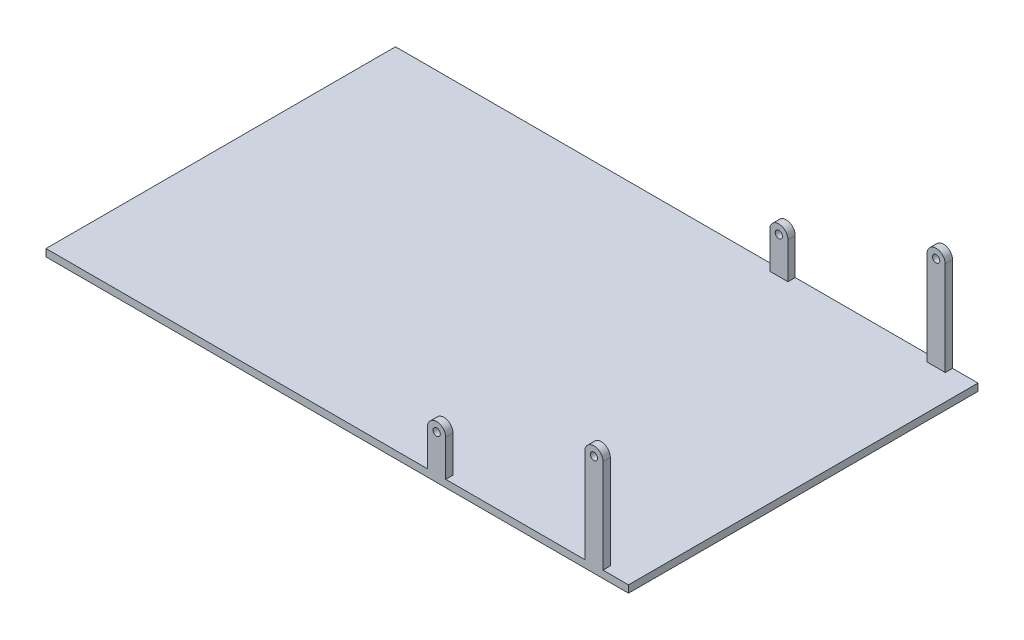
ISO-10303-21;
HEADER;
FILE_DESCRIPTION(('STEP AP214'),'2;1');
FILE_NAME('part.step','',(''),(''),'','','');
FILE_SCHEMA(('AUTOMOTIVE_DESIGN { 1 0 10303 214 1 1 1 1 }'));
ENDSEC;
DATA;
#1=APPLICATION_CONTEXT('core data for automotive mechanical design processes');
#2=APPLICATION_PROTOCOL_DEFINITION('international standard','automotive_design',2000,#1);
#3=PRODUCT_CONTEXT('',#1,'mechanical');
#4=PRODUCT('Part','Part','',(#3));
#5=PRODUCT_RELATED_PRODUCT_CATEGORY('part','',(#4));
#6=PRODUCT_DEFINITION_FORMATION('','',#4);
#7=PRODUCT_DEFINITION_CONTEXT('part definition',#1,'design');
#8=PRODUCT_DEFINITION('design','',#6,#7);
#9=PRODUCT_DEFINITION_SHAPE('','',#8);
#10=(LENGTH_UNIT() NAMED_UNIT(*) SI_UNIT(.MILLI.,.METRE.));
#11=(NAMED_UNIT(*) PLANE_ANGLE_UNIT() SI_UNIT($,.RADIAN.));
#12=(NAMED_UNIT(*) SI_UNIT($,.STERADIAN.) SOLID_ANGLE_UNIT());
#13=UNCERTAINTY_MEASURE_WITH_UNIT(LENGTH_MEASURE(1.E-05),#10,'distance_accuracy_value','');
#14=(GEOMETRIC_REPRESENTATION_CONTEXT(3) GLOBAL_UNCERTAINTY_ASSIGNED_CONTEXT((#13)) GLOBAL_UNIT_ASSIGNED_CONTEXT((#10,
#11,#12)) REPRESENTATION_CONTEXT('',''));
#15=CARTESIAN_POINT('',(0.,0.,0.));
#16=DIRECTION('',(0.,0.,1.));
#17=DIRECTION('',(1.,0.,0.));
#18=AXIS2_PLACEMENT_3D('',#15,#16,#17);
#19=CARTESIAN_POINT('',(800.,-20.,-480.));
#20=DIRECTION('',(1.,0.,0.));
#21=DIRECTION('',(0.,0.,-1.));
#22=AXIS2_PLACEMENT_3D('',#19,#20,#21);
#23=PLANE('',#22);
#24=DIRECTION('',(0.,0.,-1.));
#25=VECTOR('',#24,1.);
#26=CARTESIAN_POINT('',(800.,0.,-480.));
#27=LINE('',#26,#25);
#28=CARTESIAN_POINT('',(800.,0.,480.));
#29=VERTEX_POINT('',#28);
#30=CARTESIAN_POINT('',(800.,0.,-480.));
#31=VERTEX_POINT('',#30);
#32=EDGE_CURVE('E293',#29,#31,#27,.T.);
#33=ORIENTED_EDGE('',*,*,#32,.F.);
#34=DIRECTION('',(0.,1.,0.));
#35=VECTOR('',#34,1.);
#36=CARTESIAN_POINT('',(800.,-20.,480.));
#37=LINE('',#36,#35);
#38=CARTESIAN_POINT('',(800.,-20.,480.));
#39=VERTEX_POINT('',#38);
#40=EDGE_CURVE('E11',#39,#29,#37,.T.);
#41=ORIENTED_EDGE('',*,*,#40,.F.);
#42=DIRECTION('',(0.,0.,-1.));
#43=VECTOR('',#42,1.);
#44=CARTESIAN_POINT('',(800.,-20.,-480.));
#45=LINE('',#44,#43);
#46=CARTESIAN_POINT('',(800.,-20.,-480.));
#47=VERTEX_POINT('',#46);
#48=EDGE_CURVE('E301',#39,#47,#45,.T.);
#49=ORIENTED_EDGE('',*,*,#48,.T.);
#50=DIRECTION('',(0.,1.,0.));
#51=VECTOR('',#50,1.);
#52=CARTESIAN_POINT('',(800.,-20.,-480.));
#53=LINE('',#52,#51);
#54=EDGE_CURVE('E38',#47,#31,#53,.T.);
#55=ORIENTED_EDGE('',*,*,#54,.T.);
#56=EDGE_LOOP('',(#33,#41,#49,#55));
#57=FACE_BOUND('',#56,.T.);
#58=ADVANCED_FACE('F35',(#57),#23,.T.);
#59=CARTESIAN_POINT('',(-800.,-20.,480.));
#60=DIRECTION('',(0.,0.,1.));
#61=DIRECTION('',(1.,0.,0.));
#62=AXIS2_PLACEMENT_3D('',#59,#60,#61);
#63=PLANE('',#62);
#64=DIRECTION('',(0.,1.,0.));
#65=VECTOR('',#64,1.);
#66=CARTESIAN_POINT('',(248.,2.06501482580279E-13,480.));
#67=LINE('',#66,#65);
#68=CARTESIAN_POINT('',(248.,0.,480.));
#69=VERTEX_POINT('',#68);
#70=CARTESIAN_POINT('',(248.,100.,480.));
#71=VERTEX_POINT('',#70);
#72=EDGE_CURVE('E287',#69,#71,#67,.T.);
#73=ORIENTED_EDGE('',*,*,#72,.F.);
#74=DIRECTION('',(1.,0.,0.));
#75=VECTOR('',#74,1.);
#76=CARTESIAN_POINT('',(-800.,0.,480.));
#77=LINE('',#76,#75);
#78=CARTESIAN_POINT('',(-800.,0.,480.));
#79=VERTEX_POINT('',#78);
#80=EDGE_CURVE('E305',#79,#69,#77,.T.);
#81=ORIENTED_EDGE('',*,*,#80,.F.);
#82=DIRECTION('',(0.,1.,0.));
#83=VECTOR('',#82,1.);
#84=CARTESIAN_POINT('',(-800.,-20.,480.));
#85=LINE('',#84,#83);
#86=CARTESIAN_POINT('',(-800.,-20.,480.));
#87=VERTEX_POINT('',#86);
#88=EDGE_CURVE('E43',#87,#79,#85,.T.);
#89=ORIENTED_EDGE('',*,*,#88,.F.);
#90=DIRECTION('',(1.,0.,0.));
#91=VECTOR('',#90,1.);
#92=CARTESIAN_POINT('',(-800.,-20.,480.));
#93=LINE('',#92,#91);
#94=EDGE_CURVE('E311',#87,#39,#93,.T.);
#95=ORIENTED_EDGE('',*,*,#94,.T.);
#96=ORIENTED_EDGE('',*,*,#40,.T.);
#97=CARTESIAN_POINT('',(730.,0.,480.));
#98=VERTEX_POINT('',#97);
#99=EDGE_CURVE('E324',#98,#29,#77,.T.);
#100=ORIENTED_EDGE('',*,*,#99,.F.);
#101=DIRECTION('',(0.,1.,0.));
#102=VECTOR('',#101,1.);
#103=CARTESIAN_POINT('',(730.,0.,480.));
#104=LINE('',#103,#102);
#105=CARTESIAN_POINT('',(730.,258.2,480.));
#106=VERTEX_POINT('',#105);
#107=EDGE_CURVE('E237',#98,#106,#104,.T.);
#108=ORIENTED_EDGE('',*,*,#107,.T.);
#109=CARTESIAN_POINT('',(705.,258.2,480.));
#110=DIRECTION('',(0.,0.,1.));
#111=DIRECTION('',(1.,0.,0.));
#112=AXIS2_PLACEMENT_3D('',#109,#110,#111);
#113=CIRCLE('',#112,25.0000000000001);
#114=CARTESIAN_POINT('',(680.,258.2,480.));
#115=VERTEX_POINT('',#114);
#116=EDGE_CURVE('E250',#115,#106,#113,.F.);
#117=ORIENTED_EDGE('',*,*,#116,.F.);
#118=DIRECTION('',(0.,1.,0.));
#119=VECTOR('',#118,1.);
#120=CARTESIAN_POINT('',(680.,2.92390262101126E-13,480.));
#121=LINE('',#120,#119);
#122=CARTESIAN_POINT('',(680.,0.,480.));
#123=VERTEX_POINT('',#122);
#124=EDGE_CURVE('E253',#123,#115,#121,.T.);
#125=ORIENTED_EDGE('',*,*,#124,.F.);
#126=CARTESIAN_POINT('',(298.,0.,480.));
#127=VERTEX_POINT('',#126);
#128=EDGE_CURVE('E326',#127,#123,#77,.T.);
#129=ORIENTED_EDGE('',*,*,#128,.F.);
#130=DIRECTION('',(0.,1.,0.));
#131=VECTOR('',#130,1.);
#132=CARTESIAN_POINT('',(298.,-3.30846461338296E-13,480.));
#133=LINE('',#132,#131);
#134=CARTESIAN_POINT('',(298.,100.,480.));
#135=VERTEX_POINT('',#134);
#136=EDGE_CURVE('E272',#127,#135,#133,.T.);
#137=ORIENTED_EDGE('',*,*,#136,.T.);
#138=CARTESIAN_POINT('',(273.,100.,480.));
#139=DIRECTION('',(0.,0.,1.));
#140=DIRECTION('',(1.,0.,0.));
#141=AXIS2_PLACEMENT_3D('',#138,#139,#140);
#142=CIRCLE('',#141,25.);
#143=EDGE_CURVE('E284',#71,#135,#142,.F.);
#144=ORIENTED_EDGE('',*,*,#143,.F.);
#145=EDGE_LOOP('',(#73,#81,#89,#95,#96,#100,#108,#117,#125,#129,#137,#144));
#146=FACE_BOUND('',#145,.T.);
#147=CARTESIAN_POINT('',(273.,100.,480.));
#148=DIRECTION('',(0.,0.,1.));
#149=DIRECTION('',(1.,0.,0.));
#150=AXIS2_PLACEMENT_3D('',#147,#148,#149);
#151=CIRCLE('',#150,9.99999999999998);
#152=CARTESIAN_POINT('',(283.,100.,480.));
#153=VERTEX_POINT('',#152);
#154=EDGE_CURVE('E259',#153,#153,#151,.T.);
#155=ORIENTED_EDGE('',*,*,#154,.F.);
#156=EDGE_LOOP('',(#155));
#157=FACE_BOUND('',#156,.T.);
#158=CARTESIAN_POINT('',(705.,258.2,480.));
#159=DIRECTION('',(0.,0.,1.));
#160=DIRECTION('',(1.,0.,0.));
#161=AXIS2_PLACEMENT_3D('',#158,#159,#160);
#162=CIRCLE('',#161,9.99999999999998);
#163=CARTESIAN_POINT('',(715.,258.2,480.));
#164=VERTEX_POINT('',#163);
#165=EDGE_CURVE('E228',#164,#164,#162,.T.);
#166=ORIENTED_EDGE('',*,*,#165,.F.);
#167=EDGE_LOOP('',(#166));
#168=FACE_BOUND('',#167,.T.);
#169=ADVANCED_FACE('F351',(#146,#157,#168),#63,.T.);
#170=CARTESIAN_POINT('',(-800.,-20.,-480.));
#171=DIRECTION('',(-1.,0.,0.));
#172=DIRECTION('',(0.,0.,1.));
#173=AXIS2_PLACEMENT_3D('',#170,#171,#172);
#174=PLANE('',#173);
#175=DIRECTION('',(0.,0.,1.));
#176=VECTOR('',#175,1.);
#177=CARTESIAN_POINT('',(-800.,0.,-480.));
#178=LINE('',#177,#176);
#179=CARTESIAN_POINT('',(-800.,0.,-480.));
#180=VERTEX_POINT('',#179);
#181=EDGE_CURVE('E320',#180,#79,#178,.T.);
#182=ORIENTED_EDGE('',*,*,#181,.F.);
#183=DIRECTION('',(0.,1.,0.));
#184=VECTOR('',#183,1.);
#185=CARTESIAN_POINT('',(-800.,-20.,-480.));
#186=LINE('',#185,#184);
#187=CARTESIAN_POINT('',(-800.,-20.,-480.));
#188=VERTEX_POINT('',#187);
#189=EDGE_CURVE('E328',#188,#180,#186,.T.);
#190=ORIENTED_EDGE('',*,*,#189,.F.);
#191=DIRECTION('',(0.,0.,1.));
#192=VECTOR('',#191,1.);
#193=CARTESIAN_POINT('',(-800.,-20.,-480.));
#194=LINE('',#193,#192);
#195=EDGE_CURVE('E308',#188,#87,#194,.T.);
#196=ORIENTED_EDGE('',*,*,#195,.T.);
#197=ORIENTED_EDGE('',*,*,#88,.T.);
#198=EDGE_LOOP('',(#182,#190,#196,#197));
#199=FACE_BOUND('',#198,.T.);
#200=ADVANCED_FACE('F358',(#199),#174,.T.);
#201=CARTESIAN_POINT('',(-800.,-20.,-480.));
#202=DIRECTION('',(0.,0.,-1.));
#203=DIRECTION('',(-1.,0.,0.));
#204=AXIS2_PLACEMENT_3D('',#201,#202,#203);
#205=PLANE('',#204);
#206=DIRECTION('',(-1.,0.,0.));
#207=VECTOR('',#206,1.);
#208=CARTESIAN_POINT('',(-800.,0.,-480.));
#209=LINE('',#208,#207);
#210=CARTESIAN_POINT('',(730.,0.,-480.));
#211=VERTEX_POINT('',#210);
#212=EDGE_CURVE('E317',#31,#211,#209,.T.);
#213=ORIENTED_EDGE('',*,*,#212,.F.);
#214=ORIENTED_EDGE('',*,*,#54,.F.);
#215=DIRECTION('',(-1.,0.,0.));
#216=VECTOR('',#215,1.);
#217=CARTESIAN_POINT('',(-800.,-20.,-480.));
#218=LINE('',#217,#216);
#219=EDGE_CURVE('E304',#47,#188,#218,.T.);
#220=ORIENTED_EDGE('',*,*,#219,.T.);
#221=ORIENTED_EDGE('',*,*,#189,.T.);
#222=CARTESIAN_POINT('',(248.,0.,-480.));
#223=VERTEX_POINT('',#222);
#224=EDGE_CURVE('E316',#223,#180,#209,.T.);
#225=ORIENTED_EDGE('',*,*,#224,.F.);
#226=DIRECTION('',(0.,1.,0.));
#227=VECTOR('',#226,1.);
#228=CARTESIAN_POINT('',(248.,2.06501482580279E-13,-480.));
#229=LINE('',#228,#227);
#230=CARTESIAN_POINT('',(248.,100.,-480.));
#231=VERTEX_POINT('',#230);
#232=EDGE_CURVE('E221',#223,#231,#229,.T.);
#233=ORIENTED_EDGE('',*,*,#232,.T.);
#234=CARTESIAN_POINT('',(273.,100.,-480.));
#235=DIRECTION('',(0.,0.,1.));
#236=DIRECTION('',(1.,0.,0.));
#237=AXIS2_PLACEMENT_3D('',#234,#235,#236);
#238=CIRCLE('',#237,25.);
#239=CARTESIAN_POINT('',(298.,100.,-480.));
#240=VERTEX_POINT('',#239);
#241=EDGE_CURVE('E217',#231,#240,#238,.F.);
#242=ORIENTED_EDGE('',*,*,#241,.T.);
#243=DIRECTION('',(0.,1.,0.));
#244=VECTOR('',#243,1.);
#245=CARTESIAN_POINT('',(298.,-3.30846461338296E-13,-480.));
#246=LINE('',#245,#244);
#247=CARTESIAN_POINT('',(298.,0.,-480.));
#248=VERTEX_POINT('',#247);
#249=EDGE_CURVE('E203',#248,#240,#246,.T.);
#250=ORIENTED_EDGE('',*,*,#249,.F.);
#251=CARTESIAN_POINT('',(680.,0.,-480.));
#252=VERTEX_POINT('',#251);
#253=EDGE_CURVE('E321',#252,#248,#209,.T.);
#254=ORIENTED_EDGE('',*,*,#253,.F.);
#255=DIRECTION('',(0.,1.,0.));
#256=VECTOR('',#255,1.);
#257=CARTESIAN_POINT('',(680.,2.92390262101126E-13,-480.));
#258=LINE('',#257,#256);
#259=CARTESIAN_POINT('',(680.,258.2,-480.));
#260=VERTEX_POINT('',#259);
#261=EDGE_CURVE('E481',#252,#260,#258,.T.);
#262=ORIENTED_EDGE('',*,*,#261,.T.);
#263=CARTESIAN_POINT('',(705.,258.2,-480.));
#264=DIRECTION('',(0.,0.,1.));
#265=DIRECTION('',(1.,0.,0.));
#266=AXIS2_PLACEMENT_3D('',#263,#264,#265);
#267=CIRCLE('',#266,25.0000000000001);
#268=CARTESIAN_POINT('',(730.,258.2,-480.));
#269=VERTEX_POINT('',#268);
#270=EDGE_CURVE('E191',#260,#269,#267,.F.);
#271=ORIENTED_EDGE('',*,*,#270,.T.);
#272=DIRECTION('',(0.,1.,0.));
#273=VECTOR('',#272,1.);
#274=CARTESIAN_POINT('',(730.,0.,-480.));
#275=LINE('',#274,#273);
#276=EDGE_CURVE('E342',#211,#269,#275,.T.);
#277=ORIENTED_EDGE('',*,*,#276,.F.);
#278=EDGE_LOOP('',(#213,#214,#220,#221,#225,#233,#242,#250,#254,#262,#271,#277));
#279=FACE_BOUND('',#278,.T.);
#280=CARTESIAN_POINT('',(273.,100.,-480.));
#281=DIRECTION('',(0.,0.,1.));
#282=DIRECTION('',(1.,0.,0.));
#283=AXIS2_PLACEMENT_3D('',#280,#281,#282);
#284=CIRCLE('',#283,9.99999999999998);
#285=CARTESIAN_POINT('',(283.,100.,-480.));
#286=VERTEX_POINT('',#285);
#287=EDGE_CURVE('E214',#286,#286,#284,.T.);
#288=ORIENTED_EDGE('',*,*,#287,.T.);
#289=EDGE_LOOP('',(#288));
#290=FACE_BOUND('',#289,.T.);
#291=CARTESIAN_POINT('',(705.,258.2,-480.));
#292=DIRECTION('',(0.,0.,1.));
#293=DIRECTION('',(1.,0.,0.));
#294=AXIS2_PLACEMENT_3D('',#291,#292,#293);
#295=CIRCLE('',#294,9.99999999999998);
#296=CARTESIAN_POINT('',(715.,258.2,-480.));
#297=VERTEX_POINT('',#296);
#298=EDGE_CURVE('E485',#297,#297,#295,.T.);
#299=ORIENTED_EDGE('',*,*,#298,.T.);
#300=EDGE_LOOP('',(#299));
#301=FACE_BOUND('',#300,.T.);
#302=ADVANCED_FACE('F339',(#279,#290,#301),#205,.T.);
#303=CARTESIAN_POINT('',(0.,-20.,0.));
#304=DIRECTION('',(0.,1.,0.));
#305=DIRECTION('',(0.,0.,1.));
#306=AXIS2_PLACEMENT_3D('',#303,#304,#305);
#307=PLANE('',#306);
#308=ORIENTED_EDGE('',*,*,#48,.F.);
#309=ORIENTED_EDGE('',*,*,#94,.F.);
#310=ORIENTED_EDGE('',*,*,#195,.F.);
#311=ORIENTED_EDGE('',*,*,#219,.F.);
#312=EDGE_LOOP('',(#308,#309,#310,#311));
#313=FACE_BOUND('',#312,.T.);
#314=ADVANCED_FACE('F355',(#313),#307,.F.);
#315=CARTESIAN_POINT('',(0.,0.,0.));
#316=DIRECTION('',(0.,1.,0.));
#317=DIRECTION('',(0.,0.,1.));
#318=AXIS2_PLACEMENT_3D('',#315,#316,#317);
#319=PLANE('',#318);
#320=DIRECTION('',(0.,0.,-1.));
#321=VECTOR('',#320,1.);
#322=CARTESIAN_POINT('',(298.,0.,-460.));
#323=LINE('',#322,#321);
#324=CARTESIAN_POINT('',(298.,0.,-460.));
#325=VERTEX_POINT('',#324);
#326=EDGE_CURVE('E229',#325,#248,#323,.T.);
#327=ORIENTED_EDGE('',*,*,#326,.F.);
#328=DIRECTION('',(-1.,0.,0.));
#329=VECTOR('',#328,1.);
#330=CARTESIAN_POINT('',(0.,0.,-460.));
#331=LINE('',#330,#329);
#332=CARTESIAN_POINT('',(248.,0.,-460.));
#333=VERTEX_POINT('',#332);
#334=EDGE_CURVE('E208',#325,#333,#331,.T.);
#335=ORIENTED_EDGE('',*,*,#334,.T.);
#336=DIRECTION('',(0.,0.,-1.));
#337=VECTOR('',#336,1.);
#338=CARTESIAN_POINT('',(248.,0.,-460.));
#339=LINE('',#338,#337);
#340=EDGE_CURVE('E51',#333,#223,#339,.T.);
#341=ORIENTED_EDGE('',*,*,#340,.T.);
#342=ORIENTED_EDGE('',*,*,#224,.T.);
#343=ORIENTED_EDGE('',*,*,#181,.T.);
#344=ORIENTED_EDGE('',*,*,#80,.T.);
#345=DIRECTION('',(0.,0.,1.));
#346=VECTOR('',#345,1.);
#347=CARTESIAN_POINT('',(248.,0.,460.));
#348=LINE('',#347,#346);
#349=CARTESIAN_POINT('',(248.,0.,460.));
#350=VERTEX_POINT('',#349);
#351=EDGE_CURVE('E297',#350,#69,#348,.T.);
#352=ORIENTED_EDGE('',*,*,#351,.F.);
#353=DIRECTION('',(-1.,0.,0.));
#354=VECTOR('',#353,1.);
#355=CARTESIAN_POINT('',(0.,0.,460.));
#356=LINE('',#355,#354);
#357=CARTESIAN_POINT('',(298.,0.,460.));
#358=VERTEX_POINT('',#357);
#359=EDGE_CURVE('E276',#358,#350,#356,.T.);
#360=ORIENTED_EDGE('',*,*,#359,.F.);
#361=DIRECTION('',(0.,0.,1.));
#362=VECTOR('',#361,1.);
#363=CARTESIAN_POINT('',(298.,0.,460.));
#364=LINE('',#363,#362);
#365=EDGE_CURVE('E294',#358,#127,#364,.T.);
#366=ORIENTED_EDGE('',*,*,#365,.T.);
#367=ORIENTED_EDGE('',*,*,#128,.T.);
#368=DIRECTION('',(0.,0.,1.));
#369=VECTOR('',#368,1.);
#370=CARTESIAN_POINT('',(680.,0.,460.));
#371=LINE('',#370,#369);
#372=CARTESIAN_POINT('',(680.,0.,460.));
#373=VERTEX_POINT('',#372);
#374=EDGE_CURVE('E263',#373,#123,#371,.T.);
#375=ORIENTED_EDGE('',*,*,#374,.F.);
#376=DIRECTION('',(-1.,0.,0.));
#377=VECTOR('',#376,1.);
#378=CARTESIAN_POINT('',(0.,0.,460.));
#379=LINE('',#378,#377);
#380=CARTESIAN_POINT('',(730.,0.,460.));
#381=VERTEX_POINT('',#380);
#382=EDGE_CURVE('E241',#381,#373,#379,.T.);
#383=ORIENTED_EDGE('',*,*,#382,.F.);
#384=DIRECTION('',(0.,0.,1.));
#385=VECTOR('',#384,1.);
#386=CARTESIAN_POINT('',(730.,0.,460.));
#387=LINE('',#386,#385);
#388=EDGE_CURVE('E260',#381,#98,#387,.T.);
#389=ORIENTED_EDGE('',*,*,#388,.T.);
#390=ORIENTED_EDGE('',*,*,#99,.T.);
#391=ORIENTED_EDGE('',*,*,#32,.T.);
#392=ORIENTED_EDGE('',*,*,#212,.T.);
#393=DIRECTION('',(0.,0.,-1.));
#394=VECTOR('',#393,1.);
#395=CARTESIAN_POINT('',(730.,0.,-460.));
#396=LINE('',#395,#394);
#397=CARTESIAN_POINT('',(730.,0.,-460.));
#398=VERTEX_POINT('',#397);
#399=EDGE_CURVE('E194',#398,#211,#396,.T.);
#400=ORIENTED_EDGE('',*,*,#399,.F.);
#401=DIRECTION('',(-1.,0.,0.));
#402=VECTOR('',#401,1.);
#403=CARTESIAN_POINT('',(0.,0.,-460.));
#404=LINE('',#403,#402);
#405=CARTESIAN_POINT('',(680.,0.,-460.));
#406=VERTEX_POINT('',#405);
#407=EDGE_CURVE('E179',#398,#406,#404,.T.);
#408=ORIENTED_EDGE('',*,*,#407,.T.);
#409=DIRECTION('',(0.,0.,-1.));
#410=VECTOR('',#409,1.);
#411=CARTESIAN_POINT('',(680.,0.,-460.));
#412=LINE('',#411,#410);
#413=EDGE_CURVE('E59',#406,#252,#412,.T.);
#414=ORIENTED_EDGE('',*,*,#413,.T.);
#415=ORIENTED_EDGE('',*,*,#253,.T.);
#416=EDGE_LOOP('',(#327,#335,#341,#342,#343,#344,#352,#360,#366,#367,#375,#383,#389,#390,#391,
#392,#400,#408,#414,#415));
#417=FACE_BOUND('',#416,.T.);
#418=ADVANCED_FACE('F346',(#417),#319,.T.);
#419=CARTESIAN_POINT('',(273.,100.,460.));
#420=DIRECTION('',(0.,0.,1.));
#421=DIRECTION('',(1.,0.,0.));
#422=AXIS2_PLACEMENT_3D('',#419,#420,#421);
#423=CYLINDRICAL_SURFACE('',#422,25.);
#424=ORIENTED_EDGE('',*,*,#143,.T.);
#425=DIRECTION('',(0.,0.,1.));
#426=VECTOR('',#425,1.);
#427=CARTESIAN_POINT('',(298.,100.,460.));
#428=LINE('',#427,#426);
#429=CARTESIAN_POINT('',(298.,100.,460.));
#430=VERTEX_POINT('',#429);
#431=EDGE_CURVE('E291',#430,#135,#428,.T.);
#432=ORIENTED_EDGE('',*,*,#431,.F.);
#433=CARTESIAN_POINT('',(273.,100.,460.));
#434=DIRECTION('',(0.,0.,1.));
#435=DIRECTION('',(1.,0.,0.));
#436=AXIS2_PLACEMENT_3D('',#433,#434,#435);
#437=CIRCLE('',#436,25.);
#438=CARTESIAN_POINT('',(248.,100.,460.));
#439=VERTEX_POINT('',#438);
#440=EDGE_CURVE('E271',#439,#430,#437,.F.);
#441=ORIENTED_EDGE('',*,*,#440,.F.);
#442=DIRECTION('',(0.,0.,1.));
#443=VECTOR('',#442,1.);
#444=CARTESIAN_POINT('',(248.,100.,460.));
#445=LINE('',#444,#443);
#446=EDGE_CURVE('E281',#439,#71,#445,.T.);
#447=ORIENTED_EDGE('',*,*,#446,.T.);
#448=EDGE_LOOP('',(#424,#432,#441,#447));
#449=FACE_BOUND('',#448,.T.);
#450=ADVANCED_FACE('F368',(#449),#423,.T.);
#451=CARTESIAN_POINT('',(298.,-3.30846461338296E-13,460.));
#452=DIRECTION('',(1.,0.,0.));
#453=DIRECTION('',(0.,1.,0.));
#454=AXIS2_PLACEMENT_3D('',#451,#452,#453);
#455=PLANE('',#454);
#456=ORIENTED_EDGE('',*,*,#136,.F.);
#457=ORIENTED_EDGE('',*,*,#365,.F.);
#458=DIRECTION('',(0.,1.,0.));
#459=VECTOR('',#458,1.);
#460=CARTESIAN_POINT('',(298.,-3.30846461338296E-13,460.));
#461=LINE('',#460,#459);
#462=EDGE_CURVE('E278',#358,#430,#461,.T.);
#463=ORIENTED_EDGE('',*,*,#462,.T.);
#464=ORIENTED_EDGE('',*,*,#431,.T.);
#465=EDGE_LOOP('',(#456,#457,#463,#464));
#466=FACE_BOUND('',#465,.T.);
#467=ADVANCED_FACE('F425',(#466),#455,.T.);
#468=CARTESIAN_POINT('',(273.,100.,460.));
#469=DIRECTION('',(0.,0.,1.));
#470=DIRECTION('',(1.,0.,0.));
#471=AXIS2_PLACEMENT_3D('',#468,#469,#470);
#472=CYLINDRICAL_SURFACE('',#471,9.99999999999998);
#473=CARTESIAN_POINT('',(273.,100.,460.));
#474=DIRECTION('',(0.,0.,1.));
#475=DIRECTION('',(1.,0.,0.));
#476=AXIS2_PLACEMENT_3D('',#473,#474,#475);
#477=CIRCLE('',#476,9.99999999999998);
#478=CARTESIAN_POINT('',(283.,100.,460.));
#479=VERTEX_POINT('',#478);
#480=EDGE_CURVE('E268',#479,#479,#477,.T.);
#481=ORIENTED_EDGE('',*,*,#480,.F.);
#482=EDGE_LOOP('',(#481));
#483=FACE_BOUND('',#482,.T.);
#484=ORIENTED_EDGE('',*,*,#154,.T.);
#485=EDGE_LOOP('',(#484));
#486=FACE_BOUND('',#485,.T.);
#487=ADVANCED_FACE('F422',(#483,#486),#472,.F.);
#488=CARTESIAN_POINT('',(248.,2.06501482580279E-13,460.));
#489=DIRECTION('',(1.,0.,0.));
#490=DIRECTION('',(0.,1.,0.));
#491=AXIS2_PLACEMENT_3D('',#488,#489,#490);
#492=PLANE('',#491);
#493=ORIENTED_EDGE('',*,*,#72,.T.);
#494=ORIENTED_EDGE('',*,*,#446,.F.);
#495=DIRECTION('',(0.,1.,0.));
#496=VECTOR('',#495,1.);
#497=CARTESIAN_POINT('',(248.,2.06501482580279E-13,460.));
#498=LINE('',#497,#496);
#499=EDGE_CURVE('E274',#350,#439,#498,.T.);
#500=ORIENTED_EDGE('',*,*,#499,.F.);
#501=ORIENTED_EDGE('',*,*,#351,.T.);
#502=EDGE_LOOP('',(#493,#494,#500,#501));
#503=FACE_BOUND('',#502,.T.);
#504=ADVANCED_FACE('F364',(#503),#492,.F.);
#505=CARTESIAN_POINT('',(0.,0.,460.));
#506=DIRECTION('',(0.,0.,1.));
#507=DIRECTION('',(1.,0.,0.));
#508=AXIS2_PLACEMENT_3D('',#505,#506,#507);
#509=PLANE('',#508);
#510=ORIENTED_EDGE('',*,*,#480,.T.);
#511=EDGE_LOOP('',(#510));
#512=FACE_BOUND('',#511,.T.);
#513=ORIENTED_EDGE('',*,*,#440,.T.);
#514=ORIENTED_EDGE('',*,*,#462,.F.);
#515=ORIENTED_EDGE('',*,*,#359,.T.);
#516=ORIENTED_EDGE('',*,*,#499,.T.);
#517=EDGE_LOOP('',(#513,#514,#515,#516));
#518=FACE_BOUND('',#517,.T.);
#519=ADVANCED_FACE('F372',(#512,#518),#509,.F.);
#520=CARTESIAN_POINT('',(705.,258.2,460.));
#521=DIRECTION('',(0.,0.,1.));
#522=DIRECTION('',(1.,0.,0.));
#523=AXIS2_PLACEMENT_3D('',#520,#521,#522);
#524=CYLINDRICAL_SURFACE('',#523,25.0000000000001);
#525=ORIENTED_EDGE('',*,*,#116,.T.);
#526=DIRECTION('',(0.,0.,1.));
#527=VECTOR('',#526,1.);
#528=CARTESIAN_POINT('',(730.,258.2,460.));
#529=LINE('',#528,#527);
#530=CARTESIAN_POINT('',(730.,258.2,460.));
#531=VERTEX_POINT('',#530);
#532=EDGE_CURVE('E257',#531,#106,#529,.T.);
#533=ORIENTED_EDGE('',*,*,#532,.F.);
#534=CARTESIAN_POINT('',(705.,258.2,460.));
#535=DIRECTION('',(0.,0.,1.));
#536=DIRECTION('',(1.,0.,0.));
#537=AXIS2_PLACEMENT_3D('',#534,#535,#536);
#538=CIRCLE('',#537,25.0000000000001);
#539=CARTESIAN_POINT('',(680.,258.2,460.));
#540=VERTEX_POINT('',#539);
#541=EDGE_CURVE('E236',#540,#531,#538,.F.);
#542=ORIENTED_EDGE('',*,*,#541,.F.);
#543=DIRECTION('',(0.,0.,1.));
#544=VECTOR('',#543,1.);
#545=CARTESIAN_POINT('',(680.,258.2,460.));
#546=LINE('',#545,#544);
#547=EDGE_CURVE('E247',#540,#115,#546,.T.);
#548=ORIENTED_EDGE('',*,*,#547,.T.);
#549=EDGE_LOOP('',(#525,#533,#542,#548));
#550=FACE_BOUND('',#549,.T.);
#551=ADVANCED_FACE('F384',(#550),#524,.T.);
#552=CARTESIAN_POINT('',(730.,0.,460.));
#553=DIRECTION('',(1.,0.,0.));
#554=DIRECTION('',(0.,0.,-1.));
#555=AXIS2_PLACEMENT_3D('',#552,#553,#554);
#556=PLANE('',#555);
#557=ORIENTED_EDGE('',*,*,#107,.F.);
#558=ORIENTED_EDGE('',*,*,#388,.F.);
#559=DIRECTION('',(0.,1.,0.));
#560=VECTOR('',#559,1.);
#561=CARTESIAN_POINT('',(730.,0.,460.));
#562=LINE('',#561,#560);
#563=EDGE_CURVE('E244',#381,#531,#562,.T.);
#564=ORIENTED_EDGE('',*,*,#563,.T.);
#565=ORIENTED_EDGE('',*,*,#532,.T.);
#566=EDGE_LOOP('',(#557,#558,#564,#565));
#567=FACE_BOUND('',#566,.T.);
#568=ADVANCED_FACE('F390',(#567),#556,.T.);
#569=CARTESIAN_POINT('',(705.,258.2,460.));
#570=DIRECTION('',(0.,0.,1.));
#571=DIRECTION('',(1.,0.,0.));
#572=AXIS2_PLACEMENT_3D('',#569,#570,#571);
#573=CYLINDRICAL_SURFACE('',#572,9.99999999999998);
#574=CARTESIAN_POINT('',(705.,258.2,460.));
#575=DIRECTION('',(0.,0.,1.));
#576=DIRECTION('',(1.,0.,0.));
#577=AXIS2_PLACEMENT_3D('',#574,#575,#576);
#578=CIRCLE('',#577,9.99999999999998);
#579=CARTESIAN_POINT('',(715.,258.2,460.));
#580=VERTEX_POINT('',#579);
#581=EDGE_CURVE('E233',#580,#580,#578,.T.);
#582=ORIENTED_EDGE('',*,*,#581,.F.);
#583=EDGE_LOOP('',(#582));
#584=FACE_BOUND('',#583,.T.);
#585=ORIENTED_EDGE('',*,*,#165,.T.);
#586=EDGE_LOOP('',(#585));
#587=FACE_BOUND('',#586,.T.);
#588=ADVANCED_FACE('F392',(#584,#587),#573,.F.);
#589=CARTESIAN_POINT('',(680.,2.92390262101126E-13,460.));
#590=DIRECTION('',(1.,0.,0.));
#591=DIRECTION('',(0.,1.,0.));
#592=AXIS2_PLACEMENT_3D('',#589,#590,#591);
#593=PLANE('',#592);
#594=ORIENTED_EDGE('',*,*,#124,.T.);
#595=ORIENTED_EDGE('',*,*,#547,.F.);
#596=DIRECTION('',(0.,1.,0.));
#597=VECTOR('',#596,1.);
#598=CARTESIAN_POINT('',(680.,2.92390262101126E-13,460.));
#599=LINE('',#598,#597);
#600=EDGE_CURVE('E239',#373,#540,#599,.T.);
#601=ORIENTED_EDGE('',*,*,#600,.F.);
#602=ORIENTED_EDGE('',*,*,#374,.T.);
#603=EDGE_LOOP('',(#594,#595,#601,#602));
#604=FACE_BOUND('',#603,.T.);
#605=ADVANCED_FACE('F380',(#604),#593,.F.);
#606=CARTESIAN_POINT('',(0.,0.,460.));
#607=DIRECTION('',(0.,0.,1.));
#608=DIRECTION('',(1.,0.,0.));
#609=AXIS2_PLACEMENT_3D('',#606,#607,#608);
#610=PLANE('',#609);
#611=ORIENTED_EDGE('',*,*,#581,.T.);
#612=EDGE_LOOP('',(#611));
#613=FACE_BOUND('',#612,.T.);
#614=ORIENTED_EDGE('',*,*,#541,.T.);
#615=ORIENTED_EDGE('',*,*,#563,.F.);
#616=ORIENTED_EDGE('',*,*,#382,.T.);
#617=ORIENTED_EDGE('',*,*,#600,.T.);
#618=EDGE_LOOP('',(#614,#615,#616,#617));
#619=FACE_BOUND('',#618,.T.);
#620=ADVANCED_FACE('F388',(#613,#619),#610,.F.);
#621=CARTESIAN_POINT('',(705.,258.2,-460.));
#622=DIRECTION('',(0.,0.,-1.));
#623=DIRECTION('',(1.,0.,0.));
#624=AXIS2_PLACEMENT_3D('',#621,#622,#623);
#625=CYLINDRICAL_SURFACE('',#624,25.0000000000001);
#626=ORIENTED_EDGE('',*,*,#270,.F.);
#627=DIRECTION('',(0.,0.,-1.));
#628=VECTOR('',#627,1.);
#629=CARTESIAN_POINT('',(680.,258.2,-460.));
#630=LINE('',#629,#628);
#631=CARTESIAN_POINT('',(680.,258.2,-460.));
#632=VERTEX_POINT('',#631);
#633=EDGE_CURVE('E174',#632,#260,#630,.T.);
#634=ORIENTED_EDGE('',*,*,#633,.F.);
#635=CARTESIAN_POINT('',(705.,258.2,-460.));
#636=DIRECTION('',(0.,0.,1.));
#637=DIRECTION('',(1.,0.,0.));
#638=AXIS2_PLACEMENT_3D('',#635,#636,#637);
#639=CIRCLE('',#638,25.0000000000001);
#640=CARTESIAN_POINT('',(730.,258.2,-460.));
#641=VERTEX_POINT('',#640);
#642=EDGE_CURVE('E180',#632,#641,#639,.F.);
#643=ORIENTED_EDGE('',*,*,#642,.T.);
#644=DIRECTION('',(0.,0.,-1.));
#645=VECTOR('',#644,1.);
#646=CARTESIAN_POINT('',(730.,258.2,-460.));
#647=LINE('',#646,#645);
#648=EDGE_CURVE('E218',#641,#269,#647,.T.);
#649=ORIENTED_EDGE('',*,*,#648,.T.);
#650=EDGE_LOOP('',(#626,#634,#643,#649));
#651=FACE_BOUND('',#650,.T.);
#652=ADVANCED_FACE('F189',(#651),#625,.T.);
#653=CARTESIAN_POINT('',(705.,258.2,-460.));
#654=DIRECTION('',(0.,0.,-1.));
#655=DIRECTION('',(1.,0.,0.));
#656=AXIS2_PLACEMENT_3D('',#653,#654,#655);
#657=CYLINDRICAL_SURFACE('',#656,9.99999999999998);
#658=CARTESIAN_POINT('',(705.,258.2,-460.));
#659=DIRECTION('',(0.,0.,1.));
#660=DIRECTION('',(1.,0.,0.));
#661=AXIS2_PLACEMENT_3D('',#658,#659,#660);
#662=CIRCLE('',#661,9.99999999999998);
#663=CARTESIAN_POINT('',(715.,258.2,-460.));
#664=VERTEX_POINT('',#663);
#665=EDGE_CURVE('E187',#664,#664,#662,.T.);
#666=ORIENTED_EDGE('',*,*,#665,.T.);
#667=EDGE_LOOP('',(#666));
#668=FACE_BOUND('',#667,.T.);
#669=ORIENTED_EDGE('',*,*,#298,.F.);
#670=EDGE_LOOP('',(#669));
#671=FACE_BOUND('',#670,.T.);
#672=ADVANCED_FACE('F443',(#668,#671),#657,.F.);
#673=CARTESIAN_POINT('',(0.,0.,-460.));
#674=DIRECTION('',(0.,0.,-1.));
#675=DIRECTION('',(1.,0.,0.));
#676=AXIS2_PLACEMENT_3D('',#673,#674,#675);
#677=PLANE('',#676);
#678=ORIENTED_EDGE('',*,*,#665,.F.);
#679=EDGE_LOOP('',(#678));
#680=FACE_BOUND('',#679,.T.);
#681=ORIENTED_EDGE('',*,*,#642,.F.);
#682=DIRECTION('',(0.,1.,0.));
#683=VECTOR('',#682,1.);
#684=CARTESIAN_POINT('',(680.,2.92390262101126E-13,-460.));
#685=LINE('',#684,#683);
#686=EDGE_CURVE('E170',#406,#632,#685,.T.);
#687=ORIENTED_EDGE('',*,*,#686,.F.);
#688=ORIENTED_EDGE('',*,*,#407,.F.);
#689=DIRECTION('',(0.,1.,0.));
#690=VECTOR('',#689,1.);
#691=CARTESIAN_POINT('',(730.,0.,-460.));
#692=LINE('',#691,#690);
#693=EDGE_CURVE('E184',#398,#641,#692,.T.);
#694=ORIENTED_EDGE('',*,*,#693,.T.);
#695=EDGE_LOOP('',(#681,#687,#688,#694));
#696=FACE_BOUND('',#695,.T.);
#697=ADVANCED_FACE('F183',(#680,#696),#677,.F.);
#698=CARTESIAN_POINT('',(680.,2.92390262101126E-13,-460.));
#699=DIRECTION('',(1.,0.,0.));
#700=DIRECTION('',(0.,1.,0.));
#701=AXIS2_PLACEMENT_3D('',#698,#699,#700);
#702=PLANE('',#701);
#703=ORIENTED_EDGE('',*,*,#261,.F.);
#704=ORIENTED_EDGE('',*,*,#413,.F.);
#705=ORIENTED_EDGE('',*,*,#686,.T.);
#706=ORIENTED_EDGE('',*,*,#633,.T.);
#707=EDGE_LOOP('',(#703,#704,#705,#706));
#708=FACE_BOUND('',#707,.T.);
#709=ADVANCED_FACE('F172',(#708),#702,.F.);
#710=CARTESIAN_POINT('',(730.,0.,-460.));
#711=DIRECTION('',(1.,0.,0.));
#712=DIRECTION('',(0.,0.,1.));
#713=AXIS2_PLACEMENT_3D('',#710,#711,#712);
#714=PLANE('',#713);
#715=ORIENTED_EDGE('',*,*,#276,.T.);
#716=ORIENTED_EDGE('',*,*,#648,.F.);
#717=ORIENTED_EDGE('',*,*,#693,.F.);
#718=ORIENTED_EDGE('',*,*,#399,.T.);
#719=EDGE_LOOP('',(#715,#716,#717,#718));
#720=FACE_BOUND('',#719,.T.);
#721=ADVANCED_FACE('F455',(#720),#714,.T.);
#722=CARTESIAN_POINT('',(273.,100.,-460.));
#723=DIRECTION('',(0.,0.,-1.));
#724=DIRECTION('',(1.,0.,0.));
#725=AXIS2_PLACEMENT_3D('',#722,#723,#724);
#726=CYLINDRICAL_SURFACE('',#725,25.);
#727=ORIENTED_EDGE('',*,*,#241,.F.);
#728=DIRECTION('',(0.,0.,-1.));
#729=VECTOR('',#728,1.);
#730=CARTESIAN_POINT('',(248.,100.,-460.));
#731=LINE('',#730,#729);
#732=CARTESIAN_POINT('',(248.,100.,-460.));
#733=VERTEX_POINT('',#732);
#734=EDGE_CURVE('E213',#733,#231,#731,.T.);
#735=ORIENTED_EDGE('',*,*,#734,.F.);
#736=CARTESIAN_POINT('',(273.,100.,-460.));
#737=DIRECTION('',(0.,0.,1.));
#738=DIRECTION('',(1.,0.,0.));
#739=AXIS2_PLACEMENT_3D('',#736,#737,#738);
#740=CIRCLE('',#739,25.);
#741=CARTESIAN_POINT('',(298.,100.,-460.));
#742=VERTEX_POINT('',#741);
#743=EDGE_CURVE('E202',#733,#742,#740,.F.);
#744=ORIENTED_EDGE('',*,*,#743,.T.);
#745=DIRECTION('',(0.,0.,-1.));
#746=VECTOR('',#745,1.);
#747=CARTESIAN_POINT('',(298.,100.,-460.));
#748=LINE('',#747,#746);
#749=EDGE_CURVE('E226',#742,#240,#748,.T.);
#750=ORIENTED_EDGE('',*,*,#749,.T.);
#751=EDGE_LOOP('',(#727,#735,#744,#750));
#752=FACE_BOUND('',#751,.T.);
#753=ADVANCED_FACE('F452',(#752),#726,.T.);
#754=CARTESIAN_POINT('',(298.,-3.30846461338296E-13,-460.));
#755=DIRECTION('',(1.,0.,0.));
#756=DIRECTION('',(0.,1.,0.));
#757=AXIS2_PLACEMENT_3D('',#754,#755,#756);
#758=PLANE('',#757);
#759=ORIENTED_EDGE('',*,*,#249,.T.);
#760=ORIENTED_EDGE('',*,*,#749,.F.);
#761=DIRECTION('',(0.,1.,0.));
#762=VECTOR('',#761,1.);
#763=CARTESIAN_POINT('',(298.,-3.30846461338296E-13,-460.));
#764=LINE('',#763,#762);
#765=EDGE_CURVE('E211',#325,#742,#764,.T.);
#766=ORIENTED_EDGE('',*,*,#765,.F.);
#767=ORIENTED_EDGE('',*,*,#326,.T.);
#768=EDGE_LOOP('',(#759,#760,#766,#767));
#769=FACE_BOUND('',#768,.T.);
#770=ADVANCED_FACE('F450',(#769),#758,.T.);
#771=CARTESIAN_POINT('',(273.,100.,-460.));
#772=DIRECTION('',(0.,0.,-1.));
#773=DIRECTION('',(1.,0.,0.));
#774=AXIS2_PLACEMENT_3D('',#771,#772,#773);
#775=CYLINDRICAL_SURFACE('',#774,9.99999999999998);
#776=CARTESIAN_POINT('',(273.,100.,-460.));
#777=DIRECTION('',(0.,0.,1.));
#778=DIRECTION('',(1.,0.,0.));
#779=AXIS2_PLACEMENT_3D('',#776,#777,#778);
#780=CIRCLE('',#779,9.99999999999998);
#781=CARTESIAN_POINT('',(283.,100.,-460.));
#782=VERTEX_POINT('',#781);
#783=EDGE_CURVE('E199',#782,#782,#780,.T.);
#784=ORIENTED_EDGE('',*,*,#783,.T.);
#785=EDGE_LOOP('',(#784));
#786=FACE_BOUND('',#785,.T.);
#787=ORIENTED_EDGE('',*,*,#287,.F.);
#788=EDGE_LOOP('',(#787));
#789=FACE_BOUND('',#788,.T.);
#790=ADVANCED_FACE('F446',(#786,#789),#775,.F.);
#791=CARTESIAN_POINT('',(248.,2.06501482580279E-13,-460.));
#792=DIRECTION('',(1.,0.,0.));
#793=DIRECTION('',(0.,1.,0.));
#794=AXIS2_PLACEMENT_3D('',#791,#792,#793);
#795=PLANE('',#794);
#796=ORIENTED_EDGE('',*,*,#232,.F.);
#797=ORIENTED_EDGE('',*,*,#340,.F.);
#798=DIRECTION('',(0.,1.,0.));
#799=VECTOR('',#798,1.);
#800=CARTESIAN_POINT('',(248.,2.06501482580279E-13,-460.));
#801=LINE('',#800,#799);
#802=EDGE_CURVE('E206',#333,#733,#801,.T.);
#803=ORIENTED_EDGE('',*,*,#802,.T.);
#804=ORIENTED_EDGE('',*,*,#734,.T.);
#805=EDGE_LOOP('',(#796,#797,#803,#804));
#806=FACE_BOUND('',#805,.T.);
#807=ADVANCED_FACE('F449',(#806),#795,.F.);
#808=CARTESIAN_POINT('',(0.,0.,-460.));
#809=DIRECTION('',(0.,0.,-1.));
#810=DIRECTION('',(1.,0.,0.));
#811=AXIS2_PLACEMENT_3D('',#808,#809,#810);
#812=PLANE('',#811);
#813=ORIENTED_EDGE('',*,*,#783,.F.);
#814=EDGE_LOOP('',(#813));
#815=FACE_BOUND('',#814,.T.);
#816=ORIENTED_EDGE('',*,*,#743,.F.);
#817=ORIENTED_EDGE('',*,*,#802,.F.);
#818=ORIENTED_EDGE('',*,*,#334,.F.);
#819=ORIENTED_EDGE('',*,*,#765,.T.);
#820=EDGE_LOOP('',(#816,#817,#818,#819));
#821=FACE_BOUND('',#820,.T.);
#822=ADVANCED_FACE('F459',(#815,#821),#812,.F.);
#823=CLOSED_SHELL('',(#58,#169,#200,#302,#314,#418,#450,#467,#487,#504,#519,#551,#568,#588,#605,
#620,#652,#672,#697,#709,#721,#753,#770,#790,#807,#822));
#824=MANIFOLD_SOLID_BREP('B2',#823);
#825=ADVANCED_BREP_SHAPE_REPRESENTATION('',(#18,#824),#14);
#826=SHAPE_DEFINITION_REPRESENTATION(#9,#825);
ENDSEC;
END-ISO-10303-21;
